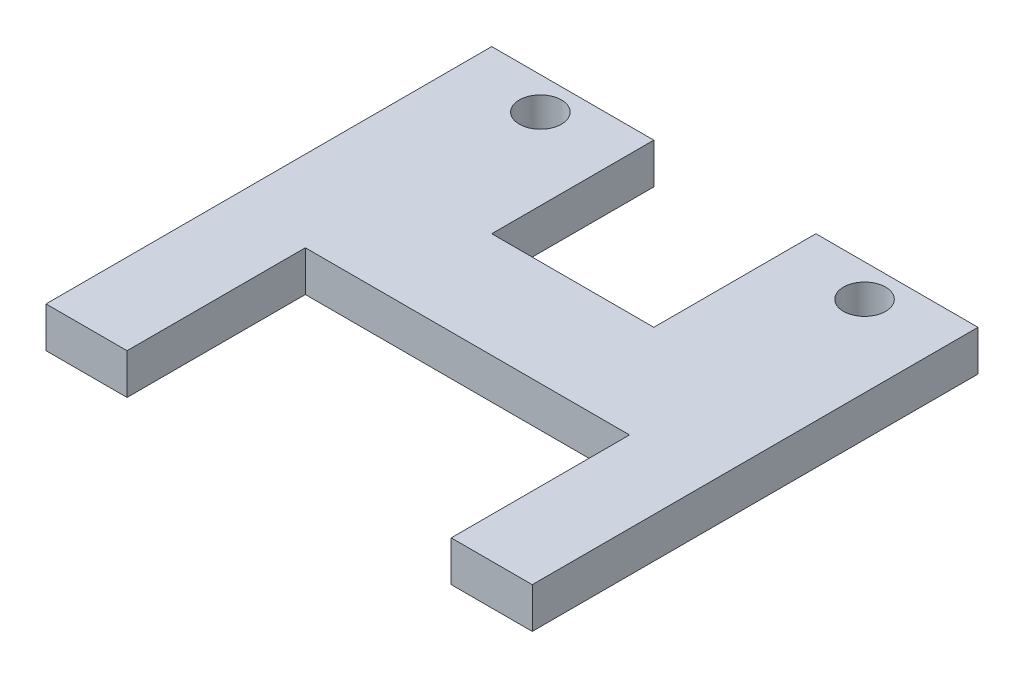
ISO-10303-21;
HEADER;
FILE_DESCRIPTION(('STEP AP214'),'2;1');
FILE_NAME('part.step','',(''),(''),'','','');
FILE_SCHEMA(('AUTOMOTIVE_DESIGN { 1 0 10303 214 1 1 1 1 }'));
ENDSEC;
DATA;
#1=APPLICATION_CONTEXT('core data for automotive mechanical design processes');
#2=APPLICATION_PROTOCOL_DEFINITION('international standard','automotive_design',2000,#1);
#3=PRODUCT_CONTEXT('',#1,'mechanical');
#4=PRODUCT('Part','Part','',(#3));
#5=PRODUCT_RELATED_PRODUCT_CATEGORY('part','',(#4));
#6=PRODUCT_DEFINITION_FORMATION('','',#4);
#7=PRODUCT_DEFINITION_CONTEXT('part definition',#1,'design');
#8=PRODUCT_DEFINITION('design','',#6,#7);
#9=PRODUCT_DEFINITION_SHAPE('','',#8);
#10=(LENGTH_UNIT() NAMED_UNIT(*) SI_UNIT(.MILLI.,.METRE.));
#11=(NAMED_UNIT(*) PLANE_ANGLE_UNIT() SI_UNIT($,.RADIAN.));
#12=(NAMED_UNIT(*) SI_UNIT($,.STERADIAN.) SOLID_ANGLE_UNIT());
#13=UNCERTAINTY_MEASURE_WITH_UNIT(LENGTH_MEASURE(1.E-05),#10,'distance_accuracy_value','');
#14=(GEOMETRIC_REPRESENTATION_CONTEXT(3) GLOBAL_UNCERTAINTY_ASSIGNED_CONTEXT((#13)) GLOBAL_UNIT_ASSIGNED_CONTEXT((#10,
#11,#12)) REPRESENTATION_CONTEXT('',''));
#15=CARTESIAN_POINT('',(0.,0.,0.));
#16=DIRECTION('',(0.,0.,1.));
#17=DIRECTION('',(1.,0.,0.));
#18=AXIS2_PLACEMENT_3D('',#15,#16,#17);
#19=CARTESIAN_POINT('',(-38.1,3.175,-34.925));
#20=DIRECTION('',(0.,0.,1.));
#21=DIRECTION('',(1.,0.,0.));
#22=AXIS2_PLACEMENT_3D('',#19,#20,#21);
#23=PLANE('',#22);
#24=DIRECTION('',(-1.,0.,0.));
#25=VECTOR('',#24,1.);
#26=CARTESIAN_POINT('',(-38.1,3.175,-34.925));
#27=LINE('',#26,#25);
#28=CARTESIAN_POINT('',(-12.7,3.175,-34.925));
#29=VERTEX_POINT('',#28);
#30=CARTESIAN_POINT('',(-38.1,3.175,-34.925));
#31=VERTEX_POINT('',#30);
#32=EDGE_CURVE('E200',#29,#31,#27,.T.);
#33=ORIENTED_EDGE('',*,*,#32,.F.);
#34=DIRECTION('',(0.,1.,0.));
#35=VECTOR('',#34,1.);
#36=CARTESIAN_POINT('',(-12.7,-3.175,-34.925));
#37=LINE('',#36,#35);
#38=CARTESIAN_POINT('',(-12.7,-3.175,-34.925));
#39=VERTEX_POINT('',#38);
#40=EDGE_CURVE('E154',#39,#29,#37,.T.);
#41=ORIENTED_EDGE('',*,*,#40,.F.);
#42=DIRECTION('',(-1.,0.,0.));
#43=VECTOR('',#42,1.);
#44=CARTESIAN_POINT('',(-38.1,-3.175,-34.925));
#45=LINE('',#44,#43);
#46=CARTESIAN_POINT('',(-38.1,-3.175,-34.925));
#47=VERTEX_POINT('',#46);
#48=EDGE_CURVE('E145',#39,#47,#45,.T.);
#49=ORIENTED_EDGE('',*,*,#48,.T.);
#50=DIRECTION('',(0.,-1.,0.));
#51=VECTOR('',#50,1.);
#52=CARTESIAN_POINT('',(-38.1,3.175,-34.925));
#53=LINE('',#52,#51);
#54=EDGE_CURVE('E43',#31,#47,#53,.T.);
#55=ORIENTED_EDGE('',*,*,#54,.F.);
#56=EDGE_LOOP('',(#33,#41,#49,#55));
#57=FACE_BOUND('',#56,.T.);
#58=ADVANCED_FACE('F35',(#57),#23,.F.);
#59=CARTESIAN_POINT('',(-38.1,3.175,34.925));
#60=DIRECTION('',(0.,0.,-1.));
#61=DIRECTION('',(-1.,0.,0.));
#62=AXIS2_PLACEMENT_3D('',#59,#60,#61);
#63=PLANE('',#62);
#64=DIRECTION('',(1.,0.,0.));
#65=VECTOR('',#64,1.);
#66=CARTESIAN_POINT('',(-38.1,-3.175,34.925));
#67=LINE('',#66,#65);
#68=CARTESIAN_POINT('',(-38.1,-3.175,34.925));
#69=VERTEX_POINT('',#68);
#70=CARTESIAN_POINT('',(-25.4,-3.175,34.925));
#71=VERTEX_POINT('',#70);
#72=EDGE_CURVE('E201',#69,#71,#67,.T.);
#73=ORIENTED_EDGE('',*,*,#72,.T.);
#74=DIRECTION('',(0.,1.,0.));
#75=VECTOR('',#74,1.);
#76=CARTESIAN_POINT('',(-25.4,-3.175,34.925));
#77=LINE('',#76,#75);
#78=CARTESIAN_POINT('',(-25.4,3.175,34.925));
#79=VERTEX_POINT('',#78);
#80=EDGE_CURVE('E181',#71,#79,#77,.T.);
#81=ORIENTED_EDGE('',*,*,#80,.T.);
#82=DIRECTION('',(1.,0.,0.));
#83=VECTOR('',#82,1.);
#84=CARTESIAN_POINT('',(-38.1,3.175,34.925));
#85=LINE('',#84,#83);
#86=CARTESIAN_POINT('',(-38.1,3.175,34.925));
#87=VERTEX_POINT('',#86);
#88=EDGE_CURVE('E208',#87,#79,#85,.T.);
#89=ORIENTED_EDGE('',*,*,#88,.F.);
#90=DIRECTION('',(0.,-1.,0.));
#91=VECTOR('',#90,1.);
#92=CARTESIAN_POINT('',(-38.1,3.175,34.925));
#93=LINE('',#92,#91);
#94=EDGE_CURVE('E224',#87,#69,#93,.T.);
#95=ORIENTED_EDGE('',*,*,#94,.T.);
#96=EDGE_LOOP('',(#73,#81,#89,#95));
#97=FACE_BOUND('',#96,.T.);
#98=ADVANCED_FACE('F237',(#97),#63,.F.);
#99=CARTESIAN_POINT('',(38.1,3.175,-34.925));
#100=DIRECTION('',(-1.,0.,0.));
#101=DIRECTION('',(0.,0.,1.));
#102=AXIS2_PLACEMENT_3D('',#99,#100,#101);
#103=PLANE('',#102);
#104=DIRECTION('',(0.,0.,-1.));
#105=VECTOR('',#104,1.);
#106=CARTESIAN_POINT('',(38.1,-3.175,-34.925));
#107=LINE('',#106,#105);
#108=CARTESIAN_POINT('',(38.1,-3.175,34.925));
#109=VERTEX_POINT('',#108);
#110=CARTESIAN_POINT('',(38.1,-3.175,-34.925));
#111=VERTEX_POINT('',#110);
#112=EDGE_CURVE('E190',#109,#111,#107,.T.);
#113=ORIENTED_EDGE('',*,*,#112,.T.);
#114=DIRECTION('',(0.,-1.,0.));
#115=VECTOR('',#114,1.);
#116=CARTESIAN_POINT('',(38.1,3.175,-34.925));
#117=LINE('',#116,#115);
#118=CARTESIAN_POINT('',(38.1,3.175,-34.925));
#119=VERTEX_POINT('',#118);
#120=EDGE_CURVE('E11',#119,#111,#117,.T.);
#121=ORIENTED_EDGE('',*,*,#120,.F.);
#122=DIRECTION('',(0.,0.,-1.));
#123=VECTOR('',#122,1.);
#124=CARTESIAN_POINT('',(38.1,3.175,-34.925));
#125=LINE('',#124,#123);
#126=CARTESIAN_POINT('',(38.1,3.175,34.925));
#127=VERTEX_POINT('',#126);
#128=EDGE_CURVE('E197',#127,#119,#125,.T.);
#129=ORIENTED_EDGE('',*,*,#128,.F.);
#130=DIRECTION('',(0.,-1.,0.));
#131=VECTOR('',#130,1.);
#132=CARTESIAN_POINT('',(38.1,3.175,34.925));
#133=LINE('',#132,#131);
#134=EDGE_CURVE('E211',#127,#109,#133,.T.);
#135=ORIENTED_EDGE('',*,*,#134,.T.);
#136=EDGE_LOOP('',(#113,#121,#129,#135));
#137=FACE_BOUND('',#136,.T.);
#138=ADVANCED_FACE('F37',(#137),#103,.F.);
#139=CARTESIAN_POINT('',(12.7,-3.175,-34.925));
#140=VERTEX_POINT('',#139);
#141=EDGE_CURVE('E214',#111,#140,#45,.T.);
#142=ORIENTED_EDGE('',*,*,#141,.T.);
#143=DIRECTION('',(0.,1.,0.));
#144=VECTOR('',#143,1.);
#145=CARTESIAN_POINT('',(12.7,-3.175,-34.925));
#146=LINE('',#145,#144);
#147=CARTESIAN_POINT('',(12.7,3.175,-34.925));
#148=VERTEX_POINT('',#147);
#149=EDGE_CURVE('E157',#140,#148,#146,.T.);
#150=ORIENTED_EDGE('',*,*,#149,.T.);
#151=EDGE_CURVE('E202',#119,#148,#27,.T.);
#152=ORIENTED_EDGE('',*,*,#151,.F.);
#153=ORIENTED_EDGE('',*,*,#120,.T.);
#154=EDGE_LOOP('',(#142,#150,#152,#153));
#155=FACE_BOUND('',#154,.T.);
#156=ADVANCED_FACE('F245',(#155),#23,.F.);
#157=CARTESIAN_POINT('',(-38.1,3.175,-34.925));
#158=DIRECTION('',(1.,0.,0.));
#159=DIRECTION('',(0.,0.,-1.));
#160=AXIS2_PLACEMENT_3D('',#157,#158,#159);
#161=PLANE('',#160);
#162=DIRECTION('',(0.,0.,1.));
#163=VECTOR('',#162,1.);
#164=CARTESIAN_POINT('',(-38.1,-3.175,-34.925));
#165=LINE('',#164,#163);
#166=EDGE_CURVE('E217',#47,#69,#165,.T.);
#167=ORIENTED_EDGE('',*,*,#166,.T.);
#168=ORIENTED_EDGE('',*,*,#94,.F.);
#169=DIRECTION('',(0.,0.,1.));
#170=VECTOR('',#169,1.);
#171=CARTESIAN_POINT('',(-38.1,3.175,-34.925));
#172=LINE('',#171,#170);
#173=EDGE_CURVE('E205',#31,#87,#172,.T.);
#174=ORIENTED_EDGE('',*,*,#173,.F.);
#175=ORIENTED_EDGE('',*,*,#54,.T.);
#176=EDGE_LOOP('',(#167,#168,#174,#175));
#177=FACE_BOUND('',#176,.T.);
#178=ADVANCED_FACE('F230',(#177),#161,.F.);
#179=CARTESIAN_POINT('',(25.4,3.175,34.925));
#180=VERTEX_POINT('',#179);
#181=EDGE_CURVE('E207',#180,#127,#85,.T.);
#182=ORIENTED_EDGE('',*,*,#181,.F.);
#183=DIRECTION('',(0.,1.,0.));
#184=VECTOR('',#183,1.);
#185=CARTESIAN_POINT('',(25.4,-3.175,34.925));
#186=LINE('',#185,#184);
#187=CARTESIAN_POINT('',(25.4,-3.175,34.925));
#188=VERTEX_POINT('',#187);
#189=EDGE_CURVE('E193',#188,#180,#186,.T.);
#190=ORIENTED_EDGE('',*,*,#189,.F.);
#191=EDGE_CURVE('E219',#188,#109,#67,.T.);
#192=ORIENTED_EDGE('',*,*,#191,.T.);
#193=ORIENTED_EDGE('',*,*,#134,.F.);
#194=EDGE_LOOP('',(#182,#190,#192,#193));
#195=FACE_BOUND('',#194,.T.);
#196=ADVANCED_FACE('F252',(#195),#63,.F.);
#197=CARTESIAN_POINT('',(0.,3.175,0.));
#198=DIRECTION('',(0.,1.,0.));
#199=DIRECTION('',(0.,0.,1.));
#200=AXIS2_PLACEMENT_3D('',#197,#198,#199);
#201=PLANE('',#200);
#202=DIRECTION('',(0.,0.,1.));
#203=VECTOR('',#202,1.);
#204=CARTESIAN_POINT('',(-12.7,3.175,-34.925));
#205=LINE('',#204,#203);
#206=CARTESIAN_POINT('',(-12.7,3.175,-9.525));
#207=VERTEX_POINT('',#206);
#208=EDGE_CURVE('E130',#29,#207,#205,.T.);
#209=ORIENTED_EDGE('',*,*,#208,.F.);
#210=ORIENTED_EDGE('',*,*,#32,.T.);
#211=ORIENTED_EDGE('',*,*,#173,.T.);
#212=ORIENTED_EDGE('',*,*,#88,.T.);
#213=DIRECTION('',(0.,0.,1.));
#214=VECTOR('',#213,1.);
#215=CARTESIAN_POINT('',(-25.4,3.175,34.925));
#216=LINE('',#215,#214);
#217=CARTESIAN_POINT('',(-25.4,3.175,6.98499999999999));
#218=VERTEX_POINT('',#217);
#219=EDGE_CURVE('E170',#218,#79,#216,.T.);
#220=ORIENTED_EDGE('',*,*,#219,.F.);
#221=DIRECTION('',(-1.,0.,0.));
#222=VECTOR('',#221,1.);
#223=CARTESIAN_POINT('',(-25.4,3.175,6.98499999999999));
#224=LINE('',#223,#222);
#225=CARTESIAN_POINT('',(25.4,3.175,6.98499999999999));
#226=VERTEX_POINT('',#225);
#227=EDGE_CURVE('E177',#226,#218,#224,.T.);
#228=ORIENTED_EDGE('',*,*,#227,.F.);
#229=DIRECTION('',(0.,0.,-1.));
#230=VECTOR('',#229,1.);
#231=CARTESIAN_POINT('',(25.4,3.175,34.925));
#232=LINE('',#231,#230);
#233=EDGE_CURVE('E183',#180,#226,#232,.T.);
#234=ORIENTED_EDGE('',*,*,#233,.F.);
#235=ORIENTED_EDGE('',*,*,#181,.T.);
#236=ORIENTED_EDGE('',*,*,#128,.T.);
#237=ORIENTED_EDGE('',*,*,#151,.T.);
#238=DIRECTION('',(0.,0.,-1.));
#239=VECTOR('',#238,1.);
#240=CARTESIAN_POINT('',(12.7,3.175,-34.925));
#241=LINE('',#240,#239);
#242=CARTESIAN_POINT('',(12.7,3.175,-9.525));
#243=VERTEX_POINT('',#242);
#244=EDGE_CURVE('E146',#243,#148,#241,.T.);
#245=ORIENTED_EDGE('',*,*,#244,.F.);
#246=DIRECTION('',(1.,0.,0.));
#247=VECTOR('',#246,1.);
#248=CARTESIAN_POINT('',(-12.7,3.175,-9.525));
#249=LINE('',#248,#247);
#250=EDGE_CURVE('E148',#207,#243,#249,.T.);
#251=ORIENTED_EDGE('',*,*,#250,.F.);
#252=EDGE_LOOP('',(#209,#210,#211,#212,#220,#228,#234,#235,#236,#237,#245,#251));
#253=FACE_BOUND('',#252,.T.);
#254=CARTESIAN_POINT('',(25.4,3.175,-29.845));
#255=DIRECTION('',(0.,1.,0.));
#256=DIRECTION('',(0.,0.,1.));
#257=AXIS2_PLACEMENT_3D('',#254,#255,#256);
#258=CIRCLE('',#257,3.302);
#259=CARTESIAN_POINT('',(25.4,3.175,-26.543));
#260=VERTEX_POINT('',#259);
#261=EDGE_CURVE('E156',#260,#260,#258,.T.);
#262=ORIENTED_EDGE('',*,*,#261,.F.);
#263=EDGE_LOOP('',(#262));
#264=FACE_BOUND('',#263,.T.);
#265=CARTESIAN_POINT('',(-25.4,3.175,-29.845));
#266=DIRECTION('',(0.,1.,0.));
#267=DIRECTION('',(0.,0.,1.));
#268=AXIS2_PLACEMENT_3D('',#265,#266,#267);
#269=CIRCLE('',#268,3.302);
#270=CARTESIAN_POINT('',(-25.4,3.175,-26.543));
#271=VERTEX_POINT('',#270);
#272=EDGE_CURVE('E164',#271,#271,#269,.T.);
#273=ORIENTED_EDGE('',*,*,#272,.F.);
#274=EDGE_LOOP('',(#273));
#275=FACE_BOUND('',#274,.T.);
#276=ADVANCED_FACE('F241',(#253,#264,#275),#201,.T.);
#277=CARTESIAN_POINT('',(0.,-3.175,0.));
#278=DIRECTION('',(0.,1.,0.));
#279=DIRECTION('',(0.,0.,1.));
#280=AXIS2_PLACEMENT_3D('',#277,#278,#279);
#281=PLANE('',#280);
#282=ORIENTED_EDGE('',*,*,#48,.F.);
#283=DIRECTION('',(0.,0.,1.));
#284=VECTOR('',#283,1.);
#285=CARTESIAN_POINT('',(-12.7,-3.175,-34.925));
#286=LINE('',#285,#284);
#287=CARTESIAN_POINT('',(-12.7,-3.175,-9.525));
#288=VERTEX_POINT('',#287);
#289=EDGE_CURVE('E127',#39,#288,#286,.T.);
#290=ORIENTED_EDGE('',*,*,#289,.T.);
#291=DIRECTION('',(1.,0.,0.));
#292=VECTOR('',#291,1.);
#293=CARTESIAN_POINT('',(-12.7,-3.175,-9.525));
#294=LINE('',#293,#292);
#295=CARTESIAN_POINT('',(12.7,-3.175,-9.525));
#296=VERTEX_POINT('',#295);
#297=EDGE_CURVE('E137',#288,#296,#294,.T.);
#298=ORIENTED_EDGE('',*,*,#297,.T.);
#299=DIRECTION('',(0.,0.,-1.));
#300=VECTOR('',#299,1.);
#301=CARTESIAN_POINT('',(12.7,-3.175,-34.925));
#302=LINE('',#301,#300);
#303=EDGE_CURVE('E50',#296,#140,#302,.T.);
#304=ORIENTED_EDGE('',*,*,#303,.T.);
#305=ORIENTED_EDGE('',*,*,#141,.F.);
#306=ORIENTED_EDGE('',*,*,#112,.F.);
#307=ORIENTED_EDGE('',*,*,#191,.F.);
#308=DIRECTION('',(0.,0.,-1.));
#309=VECTOR('',#308,1.);
#310=CARTESIAN_POINT('',(25.4,-3.175,34.925));
#311=LINE('',#310,#309);
#312=CARTESIAN_POINT('',(25.4,-3.175,6.98499999999999));
#313=VERTEX_POINT('',#312);
#314=EDGE_CURVE('E176',#188,#313,#311,.T.);
#315=ORIENTED_EDGE('',*,*,#314,.T.);
#316=DIRECTION('',(-1.,0.,0.));
#317=VECTOR('',#316,1.);
#318=CARTESIAN_POINT('',(-25.4,-3.175,6.98499999999999));
#319=LINE('',#318,#317);
#320=CARTESIAN_POINT('',(-25.4,-3.175,6.98499999999999));
#321=VERTEX_POINT('',#320);
#322=EDGE_CURVE('E58',#313,#321,#319,.T.);
#323=ORIENTED_EDGE('',*,*,#322,.T.);
#324=DIRECTION('',(0.,0.,1.));
#325=VECTOR('',#324,1.);
#326=CARTESIAN_POINT('',(-25.4,-3.175,34.925));
#327=LINE('',#326,#325);
#328=EDGE_CURVE('E173',#321,#71,#327,.T.);
#329=ORIENTED_EDGE('',*,*,#328,.T.);
#330=ORIENTED_EDGE('',*,*,#72,.F.);
#331=ORIENTED_EDGE('',*,*,#166,.F.);
#332=EDGE_LOOP('',(#282,#290,#298,#304,#305,#306,#307,#315,#323,#329,#330,#331));
#333=FACE_BOUND('',#332,.T.);
#334=CARTESIAN_POINT('',(25.4,-3.175,-29.845));
#335=DIRECTION('',(0.,1.,0.));
#336=DIRECTION('',(0.,0.,1.));
#337=AXIS2_PLACEMENT_3D('',#334,#335,#336);
#338=CIRCLE('',#337,3.302);
#339=CARTESIAN_POINT('',(25.4,-3.175,-26.543));
#340=VERTEX_POINT('',#339);
#341=EDGE_CURVE('E161',#340,#340,#338,.T.);
#342=ORIENTED_EDGE('',*,*,#341,.T.);
#343=EDGE_LOOP('',(#342));
#344=FACE_BOUND('',#343,.T.);
#345=CARTESIAN_POINT('',(-25.4,-3.175,-29.845));
#346=DIRECTION('',(0.,1.,0.));
#347=DIRECTION('',(0.,0.,1.));
#348=AXIS2_PLACEMENT_3D('',#345,#346,#347);
#349=CIRCLE('',#348,3.302);
#350=CARTESIAN_POINT('',(-25.4,-3.175,-26.543));
#351=VERTEX_POINT('',#350);
#352=EDGE_CURVE('E167',#351,#351,#349,.T.);
#353=ORIENTED_EDGE('',*,*,#352,.T.);
#354=EDGE_LOOP('',(#353));
#355=FACE_BOUND('',#354,.T.);
#356=ADVANCED_FACE('F142',(#333,#344,#355),#281,.F.);
#357=CARTESIAN_POINT('',(-25.4,-3.175,34.925));
#358=DIRECTION('',(-1.,0.,0.));
#359=DIRECTION('',(0.,0.,1.));
#360=AXIS2_PLACEMENT_3D('',#357,#358,#359);
#361=PLANE('',#360);
#362=ORIENTED_EDGE('',*,*,#219,.T.);
#363=ORIENTED_EDGE('',*,*,#80,.F.);
#364=ORIENTED_EDGE('',*,*,#328,.F.);
#365=DIRECTION('',(0.,1.,0.));
#366=VECTOR('',#365,1.);
#367=CARTESIAN_POINT('',(-25.4,-3.175,6.98499999999999));
#368=LINE('',#367,#366);
#369=EDGE_CURVE('E188',#321,#218,#368,.T.);
#370=ORIENTED_EDGE('',*,*,#369,.T.);
#371=EDGE_LOOP('',(#362,#363,#364,#370));
#372=FACE_BOUND('',#371,.T.);
#373=ADVANCED_FACE('F274',(#372),#361,.F.);
#374=CARTESIAN_POINT('',(-25.4,-3.175,6.98499999999999));
#375=DIRECTION('',(0.,0.,-1.));
#376=DIRECTION('',(-1.,0.,0.));
#377=AXIS2_PLACEMENT_3D('',#374,#375,#376);
#378=PLANE('',#377);
#379=ORIENTED_EDGE('',*,*,#227,.T.);
#380=ORIENTED_EDGE('',*,*,#369,.F.);
#381=ORIENTED_EDGE('',*,*,#322,.F.);
#382=DIRECTION('',(0.,1.,0.));
#383=VECTOR('',#382,1.);
#384=CARTESIAN_POINT('',(25.4,-3.175,6.98499999999999));
#385=LINE('',#384,#383);
#386=EDGE_CURVE('E191',#313,#226,#385,.T.);
#387=ORIENTED_EDGE('',*,*,#386,.T.);
#388=EDGE_LOOP('',(#379,#380,#381,#387));
#389=FACE_BOUND('',#388,.T.);
#390=ADVANCED_FACE('F272',(#389),#378,.F.);
#391=CARTESIAN_POINT('',(25.4,-3.175,34.925));
#392=DIRECTION('',(1.,0.,0.));
#393=DIRECTION('',(0.,0.,-1.));
#394=AXIS2_PLACEMENT_3D('',#391,#392,#393);
#395=PLANE('',#394);
#396=ORIENTED_EDGE('',*,*,#233,.T.);
#397=ORIENTED_EDGE('',*,*,#386,.F.);
#398=ORIENTED_EDGE('',*,*,#314,.F.);
#399=ORIENTED_EDGE('',*,*,#189,.T.);
#400=EDGE_LOOP('',(#396,#397,#398,#399));
#401=FACE_BOUND('',#400,.T.);
#402=ADVANCED_FACE('F271',(#401),#395,.F.);
#403=CARTESIAN_POINT('',(-25.4,-3.175,-29.845));
#404=DIRECTION('',(0.,1.,0.));
#405=DIRECTION('',(0.,0.,1.));
#406=AXIS2_PLACEMENT_3D('',#403,#404,#405);
#407=CYLINDRICAL_SURFACE('',#406,3.302);
#408=ORIENTED_EDGE('',*,*,#352,.F.);
#409=EDGE_LOOP('',(#408));
#410=FACE_BOUND('',#409,.T.);
#411=ORIENTED_EDGE('',*,*,#272,.T.);
#412=EDGE_LOOP('',(#411));
#413=FACE_BOUND('',#412,.T.);
#414=ADVANCED_FACE('F310',(#410,#413),#407,.F.);
#415=CARTESIAN_POINT('',(25.4,-3.175,-29.845));
#416=DIRECTION('',(0.,1.,0.));
#417=DIRECTION('',(0.,0.,1.));
#418=AXIS2_PLACEMENT_3D('',#415,#416,#417);
#419=CYLINDRICAL_SURFACE('',#418,3.302);
#420=ORIENTED_EDGE('',*,*,#341,.F.);
#421=EDGE_LOOP('',(#420));
#422=FACE_BOUND('',#421,.T.);
#423=ORIENTED_EDGE('',*,*,#261,.T.);
#424=EDGE_LOOP('',(#423));
#425=FACE_BOUND('',#424,.T.);
#426=ADVANCED_FACE('F317',(#422,#425),#419,.F.);
#427=CARTESIAN_POINT('',(-12.7,-3.175,-34.925));
#428=DIRECTION('',(-1.,0.,0.));
#429=DIRECTION('',(0.,0.,1.));
#430=AXIS2_PLACEMENT_3D('',#427,#428,#429);
#431=PLANE('',#430);
#432=ORIENTED_EDGE('',*,*,#208,.T.);
#433=DIRECTION('',(0.,1.,0.));
#434=VECTOR('',#433,1.);
#435=CARTESIAN_POINT('',(-12.7,-3.175,-9.525));
#436=LINE('',#435,#434);
#437=EDGE_CURVE('E123',#288,#207,#436,.T.);
#438=ORIENTED_EDGE('',*,*,#437,.F.);
#439=ORIENTED_EDGE('',*,*,#289,.F.);
#440=ORIENTED_EDGE('',*,*,#40,.T.);
#441=EDGE_LOOP('',(#432,#438,#439,#440));
#442=FACE_BOUND('',#441,.T.);
#443=ADVANCED_FACE('F125',(#442),#431,.F.);
#444=CARTESIAN_POINT('',(12.7,-3.175,-34.925));
#445=DIRECTION('',(1.,0.,0.));
#446=DIRECTION('',(0.,0.,-1.));
#447=AXIS2_PLACEMENT_3D('',#444,#445,#446);
#448=PLANE('',#447);
#449=ORIENTED_EDGE('',*,*,#244,.T.);
#450=ORIENTED_EDGE('',*,*,#149,.F.);
#451=ORIENTED_EDGE('',*,*,#303,.F.);
#452=DIRECTION('',(0.,1.,0.));
#453=VECTOR('',#452,1.);
#454=CARTESIAN_POINT('',(12.7,-3.175,-9.525));
#455=LINE('',#454,#453);
#456=EDGE_CURVE('E134',#296,#243,#455,.T.);
#457=ORIENTED_EDGE('',*,*,#456,.T.);
#458=EDGE_LOOP('',(#449,#450,#451,#457));
#459=FACE_BOUND('',#458,.T.);
#460=ADVANCED_FACE('F335',(#459),#448,.F.);
#461=CARTESIAN_POINT('',(-12.7,-3.175,-9.525));
#462=DIRECTION('',(0.,0.,1.));
#463=DIRECTION('',(1.,0.,0.));
#464=AXIS2_PLACEMENT_3D('',#461,#462,#463);
#465=PLANE('',#464);
#466=ORIENTED_EDGE('',*,*,#250,.T.);
#467=ORIENTED_EDGE('',*,*,#456,.F.);
#468=ORIENTED_EDGE('',*,*,#297,.F.);
#469=ORIENTED_EDGE('',*,*,#437,.T.);
#470=EDGE_LOOP('',(#466,#467,#468,#469));
#471=FACE_BOUND('',#470,.T.);
#472=ADVANCED_FACE('F138',(#471),#465,.F.);
#473=CLOSED_SHELL('',(#58,#98,#138,#156,#178,#196,#276,#356,#373,#390,#402,#414,#426,#443,#460,#472));
#474=MANIFOLD_SOLID_BREP('B2',#473);
#475=ADVANCED_BREP_SHAPE_REPRESENTATION('',(#18,#474),#14);
#476=SHAPE_DEFINITION_REPRESENTATION(#9,#475);
ENDSEC;
END-ISO-10303-21;
